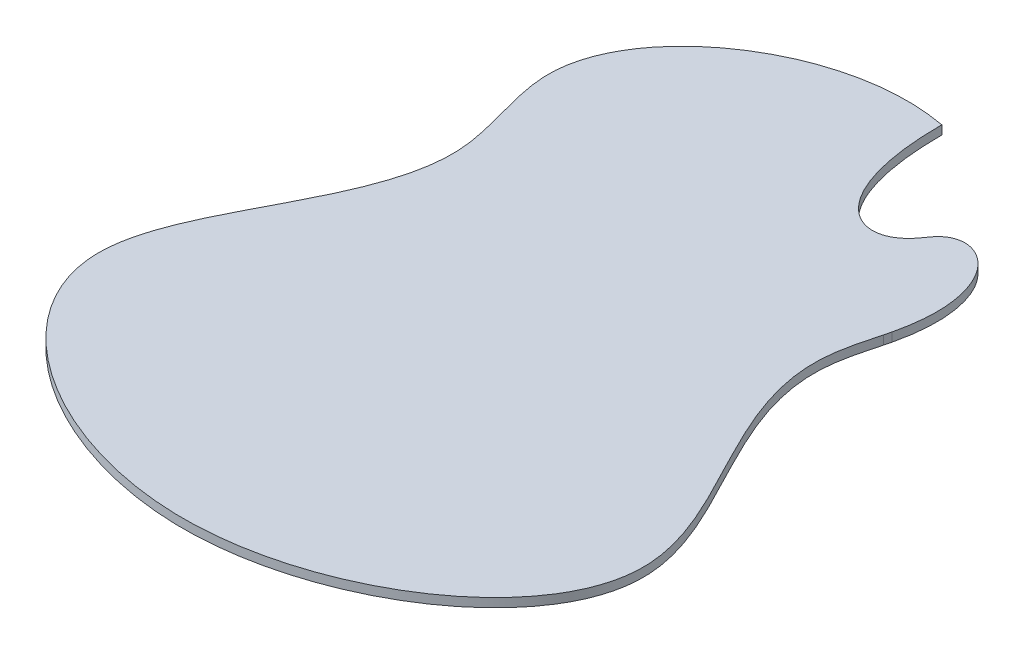
ISO-10303-21;
HEADER;
FILE_DESCRIPTION(('STEP AP214'),'2;1');
FILE_NAME('part.step','',(''),(''),'','','');
FILE_SCHEMA(('AUTOMOTIVE_DESIGN { 1 0 10303 214 1 1 1 1 }'));
ENDSEC;
DATA;
#1=APPLICATION_CONTEXT('core data for automotive mechanical design processes');
#2=APPLICATION_PROTOCOL_DEFINITION('international standard','automotive_design',2000,#1);
#3=PRODUCT_CONTEXT('',#1,'mechanical');
#4=PRODUCT('Part','Part','',(#3));
#5=PRODUCT_RELATED_PRODUCT_CATEGORY('part','',(#4));
#6=PRODUCT_DEFINITION_FORMATION('','',#4);
#7=PRODUCT_DEFINITION_CONTEXT('part definition',#1,'design');
#8=PRODUCT_DEFINITION('design','',#6,#7);
#9=PRODUCT_DEFINITION_SHAPE('','',#8);
#10=(LENGTH_UNIT() NAMED_UNIT(*) SI_UNIT(.MILLI.,.METRE.));
#11=(NAMED_UNIT(*) PLANE_ANGLE_UNIT() SI_UNIT($,.RADIAN.));
#12=(NAMED_UNIT(*) SI_UNIT($,.STERADIAN.) SOLID_ANGLE_UNIT());
#13=UNCERTAINTY_MEASURE_WITH_UNIT(LENGTH_MEASURE(1.E-05),#10,'distance_accuracy_value','');
#14=(GEOMETRIC_REPRESENTATION_CONTEXT(3) GLOBAL_UNCERTAINTY_ASSIGNED_CONTEXT((#13)) GLOBAL_UNIT_ASSIGNED_CONTEXT((#10,
#11,#12)) REPRESENTATION_CONTEXT('',''));
#15=CARTESIAN_POINT('',(0.,0.,0.));
#16=DIRECTION('',(0.,0.,1.));
#17=DIRECTION('',(1.,0.,0.));
#18=AXIS2_PLACEMENT_3D('',#15,#16,#17);
#19=CARTESIAN_POINT('',(26.0000000000001,-81.,-242.13340875045));
#20=CARTESIAN_POINT('',(26.0016963456655,-81.,-158.206100516965));
#21=CARTESIAN_POINT('',(68.3044033744698,-81.,-141.462561954249));
#22=CARTESIAN_POINT('',(102.770077733588,-81.,-197.29518162325));
#23=CARTESIAN_POINT('',(145.379427970351,-81.,-166.902341998054));
#24=CARTESIAN_POINT('',(130.390556957844,-81.,-103.947736036381));
#25=B_SPLINE_CURVE_WITH_KNOTS('',3,(#19,#20,#21,#22,#23,#24),.UNSPECIFIED.,.F.,.F.,(4,1,1,4),
(0.,0.502034683154234,0.548532874477827,0.989753040085366),.UNSPECIFIED.);
#26=DIRECTION('',(0.,-1.,0.));
#27=VECTOR('',#26,1.);
#28=SURFACE_OF_LINEAR_EXTRUSION('',#25,#27);
#29=CARTESIAN_POINT('',(130.390556957844,-87.,-103.947736036381));
#30=CARTESIAN_POINT('',(145.379427970351,-87.,-166.902341998054));
#31=CARTESIAN_POINT('',(102.770077733588,-87.,-197.29518162325));
#32=CARTESIAN_POINT('',(68.3044033744698,-87.,-141.462561954249));
#33=CARTESIAN_POINT('',(26.0016963456655,-87.,-158.206100516965));
#34=CARTESIAN_POINT('',(26.0000000000001,-87.,-242.13340875045));
#35=B_SPLINE_CURVE_WITH_KNOTS('',3,(#29,#30,#31,#32,#33,#34),.UNSPECIFIED.,.F.,.F.,(4,1,1,4),
(0.,0.441220165607539,0.487718356931132,0.989753040085366),.UNSPECIFIED.);
#36=CARTESIAN_POINT('',(26.,-87.,-242.13340875045));
#37=VERTEX_POINT('',#36);
#38=CARTESIAN_POINT('',(130.390556957844,-87.,-103.947736036382));
#39=VERTEX_POINT('',#38);
#40=EDGE_CURVE('E122',#37,#39,#35,.F.);
#41=ORIENTED_EDGE('',*,*,#40,.F.);
#42=DIRECTION('',(0.,1.,0.));
#43=VECTOR('',#42,1.);
#44=CARTESIAN_POINT('',(26.,-87.,-242.13340875045));
#45=LINE('',#44,#43);
#46=CARTESIAN_POINT('',(26.,-81.,-242.13340875045));
#47=VERTEX_POINT('',#46);
#48=EDGE_CURVE('E11',#37,#47,#45,.T.);
#49=ORIENTED_EDGE('',*,*,#48,.T.);
#50=CARTESIAN_POINT('',(26.0000000000001,-81.,-242.13340875045));
#51=CARTESIAN_POINT('',(26.0016963456655,-81.,-158.206100516965));
#52=CARTESIAN_POINT('',(68.3044033744698,-81.,-141.462561954249));
#53=CARTESIAN_POINT('',(102.770077733588,-81.,-197.29518162325));
#54=CARTESIAN_POINT('',(145.379427970351,-81.,-166.902341998054));
#55=CARTESIAN_POINT('',(130.390556957844,-81.,-103.947736036381));
#56=B_SPLINE_CURVE_WITH_KNOTS('',3,(#50,#51,#52,#53,#54,#55),.UNSPECIFIED.,.F.,.F.,(4,1,1,4),
(0.,0.502034683154234,0.548532874477827,0.989753040085366),.UNSPECIFIED.);
#57=CARTESIAN_POINT('',(130.390556957844,-81.,-103.947736036382));
#58=VERTEX_POINT('',#57);
#59=EDGE_CURVE('E85',#47,#58,#56,.T.);
#60=ORIENTED_EDGE('',*,*,#59,.T.);
#61=DIRECTION('',(0.,-1.,0.));
#62=VECTOR('',#61,1.);
#63=CARTESIAN_POINT('',(130.390556957844,-81.,-103.947736036382));
#64=LINE('',#63,#62);
#65=EDGE_CURVE('E70',#58,#39,#64,.T.);
#66=ORIENTED_EDGE('',*,*,#65,.T.);
#67=EDGE_LOOP('',(#41,#49,#60,#66));
#68=FACE_BOUND('',#67,.T.);
#69=ADVANCED_FACE('F34',(#68),#28,.T.);
#70=CARTESIAN_POINT('',(130.390556957844,-81.,-103.947736036382));
#71=DIRECTION('',(0.969045429436718,0.,0.246882473431805));
#72=DIRECTION('',(0.246882473431805,0.,-0.969045429436719));
#73=AXIS2_PLACEMENT_3D('',#70,#71,#72);
#74=PLANE('',#73);
#75=DIRECTION('',(-0.246882473431805,0.,0.969045429436718));
#76=VECTOR('',#75,1.);
#77=CARTESIAN_POINT('',(130.390556957844,-87.,-103.947736036382));
#78=LINE('',#77,#76);
#79=CARTESIAN_POINT('',(129.257412896194,-87.,-99.4999999999949));
#80=VERTEX_POINT('',#79);
#81=EDGE_CURVE('E75',#39,#80,#78,.T.);
#82=ORIENTED_EDGE('',*,*,#81,.F.);
#83=ORIENTED_EDGE('',*,*,#65,.F.);
#84=DIRECTION('',(-0.246882473431805,0.,0.969045429436718));
#85=VECTOR('',#84,1.);
#86=CARTESIAN_POINT('',(130.390556957844,-81.,-103.947736036382));
#87=LINE('',#86,#85);
#88=CARTESIAN_POINT('',(129.257412896194,-81.,-99.4999999999949));
#89=VERTEX_POINT('',#88);
#90=EDGE_CURVE('E73',#58,#89,#87,.T.);
#91=ORIENTED_EDGE('',*,*,#90,.T.);
#92=DIRECTION('',(0.,1.,0.));
#93=VECTOR('',#92,1.);
#94=CARTESIAN_POINT('',(129.257412896194,-87.,-99.4999999999949));
#95=LINE('',#94,#93);
#96=EDGE_CURVE('E47',#80,#89,#95,.T.);
#97=ORIENTED_EDGE('',*,*,#96,.F.);
#98=EDGE_LOOP('',(#82,#83,#91,#97));
#99=FACE_BOUND('',#98,.T.);
#100=ADVANCED_FACE('F72',(#99),#74,.T.);
#101=CARTESIAN_POINT('',(129.257412896194,-87.,-99.4999999999948));
#102=CARTESIAN_POINT('',(126.282678231945,-87.,-88.5305216501639));
#103=CARTESIAN_POINT('',(106.024941887262,-87.,-12.6367460895683));
#104=CARTESIAN_POINT('',(262.593496584014,-87.,133.359561301183));
#105=CARTESIAN_POINT('',(0.,-87.,303.59554715671));
#106=CARTESIAN_POINT('',(-262.593496584014,-87.,133.359561301183));
#107=CARTESIAN_POINT('',(-91.8119880949053,-87.,-25.8899742030832));
#108=CARTESIAN_POINT('',(-165.338525024778,-87.,-172.995524855486));
#109=CARTESIAN_POINT('',(-67.9952389869538,-87.,-244.5));
#110=CARTESIAN_POINT('',(0.,-87.,-244.5));
#111=CARTESIAN_POINT('',(8.71401558861115,-87.,-244.5));
#112=CARTESIAN_POINT('',(17.4280311772223,-87.,-243.679676069569));
#113=CARTESIAN_POINT('',(26.,-87.,-242.13340875045));
#114=B_SPLINE_CURVE_WITH_KNOTS('',3,(#101,#102,#103,#104,#105,#106,#107,#108,#109,#110,#111,
#112,#113),.UNSPECIFIED.,.F.,.F.,(4,1,1,1,1,1,1,3,4),(0.98340315945768,1.00846613761703,
1.15578648633522,1.32306470244555,1.49034291855587,1.63766326727406,1.69355998356734,
1.82306470244555,1.83966154298787),.UNSPECIFIED.);
#115=DIRECTION('',(0.,1.,0.));
#116=VECTOR('',#115,1.);
#117=SURFACE_OF_LINEAR_EXTRUSION('',#114,#116);
#118=CARTESIAN_POINT('',(129.257412896194,-81.,-99.4999999999948));
#119=CARTESIAN_POINT('',(126.282678231945,-81.,-88.5305216501639));
#120=CARTESIAN_POINT('',(106.024941887262,-81.,-12.6367460895683));
#121=CARTESIAN_POINT('',(262.593496584014,-81.,133.359561301183));
#122=CARTESIAN_POINT('',(0.,-81.,303.59554715671));
#123=CARTESIAN_POINT('',(-262.593496584014,-81.,133.359561301183));
#124=CARTESIAN_POINT('',(-91.8119880949053,-81.,-25.8899742030832));
#125=CARTESIAN_POINT('',(-165.338525024778,-81.,-172.995524855486));
#126=CARTESIAN_POINT('',(-67.9952389869538,-81.,-244.5));
#127=CARTESIAN_POINT('',(0.,-81.,-244.5));
#128=CARTESIAN_POINT('',(8.71401558861115,-81.,-244.5));
#129=CARTESIAN_POINT('',(17.4280311772223,-81.,-243.679676069569));
#130=CARTESIAN_POINT('',(26.,-81.,-242.13340875045));
#131=B_SPLINE_CURVE_WITH_KNOTS('',3,(#118,#119,#120,#121,#122,#123,#124,#125,#126,#127,#128,
#129,#130),.UNSPECIFIED.,.F.,.F.,(4,1,1,1,1,1,1,3,4),(0.98340315945768,1.00846613761703,
1.15578648633522,1.32306470244555,1.49034291855587,1.63766326727406,1.69355998356734,
1.82306470244555,1.83966154298787),.UNSPECIFIED.);
#132=EDGE_CURVE('E80',#89,#47,#131,.T.);
#133=ORIENTED_EDGE('',*,*,#132,.T.);
#134=ORIENTED_EDGE('',*,*,#48,.F.);
#135=EDGE_CURVE('E55',#80,#37,#114,.T.);
#136=ORIENTED_EDGE('',*,*,#135,.F.);
#137=ORIENTED_EDGE('',*,*,#96,.T.);
#138=EDGE_LOOP('',(#133,#134,#136,#137));
#139=FACE_BOUND('',#138,.T.);
#140=ADVANCED_FACE('F36',(#139),#117,.F.);
#141=CARTESIAN_POINT('',(-131.393883847086,-87.,202.64757536859));
#142=DIRECTION('',(0.,-1.,0.));
#143=DIRECTION('',(0.,0.,-1.));
#144=AXIS2_PLACEMENT_3D('',#141,#142,#143);
#145=PLANE('',#144);
#146=ORIENTED_EDGE('',*,*,#135,.T.);
#147=ORIENTED_EDGE('',*,*,#40,.T.);
#148=ORIENTED_EDGE('',*,*,#81,.T.);
#149=EDGE_LOOP('',(#146,#147,#148));
#150=FACE_BOUND('',#149,.T.);
#151=ADVANCED_FACE('F107',(#150),#145,.T.);
#152=CARTESIAN_POINT('',(-131.393883847086,-81.,202.64757536859));
#153=DIRECTION('',(0.,-1.,0.));
#154=DIRECTION('',(0.,0.,-1.));
#155=AXIS2_PLACEMENT_3D('',#152,#153,#154);
#156=PLANE('',#155);
#157=ORIENTED_EDGE('',*,*,#132,.F.);
#158=ORIENTED_EDGE('',*,*,#90,.F.);
#159=ORIENTED_EDGE('',*,*,#59,.F.);
#160=EDGE_LOOP('',(#157,#158,#159));
#161=FACE_BOUND('',#160,.T.);
#162=ADVANCED_FACE('F84',(#161),#156,.F.);
#163=CLOSED_SHELL('',(#69,#100,#140,#151,#162));
#164=MANIFOLD_SOLID_BREP('B2',#163);
#165=ADVANCED_BREP_SHAPE_REPRESENTATION('',(#18,#164),#14);
#166=SHAPE_DEFINITION_REPRESENTATION(#9,#165);
ENDSEC;
END-ISO-10303-21;
